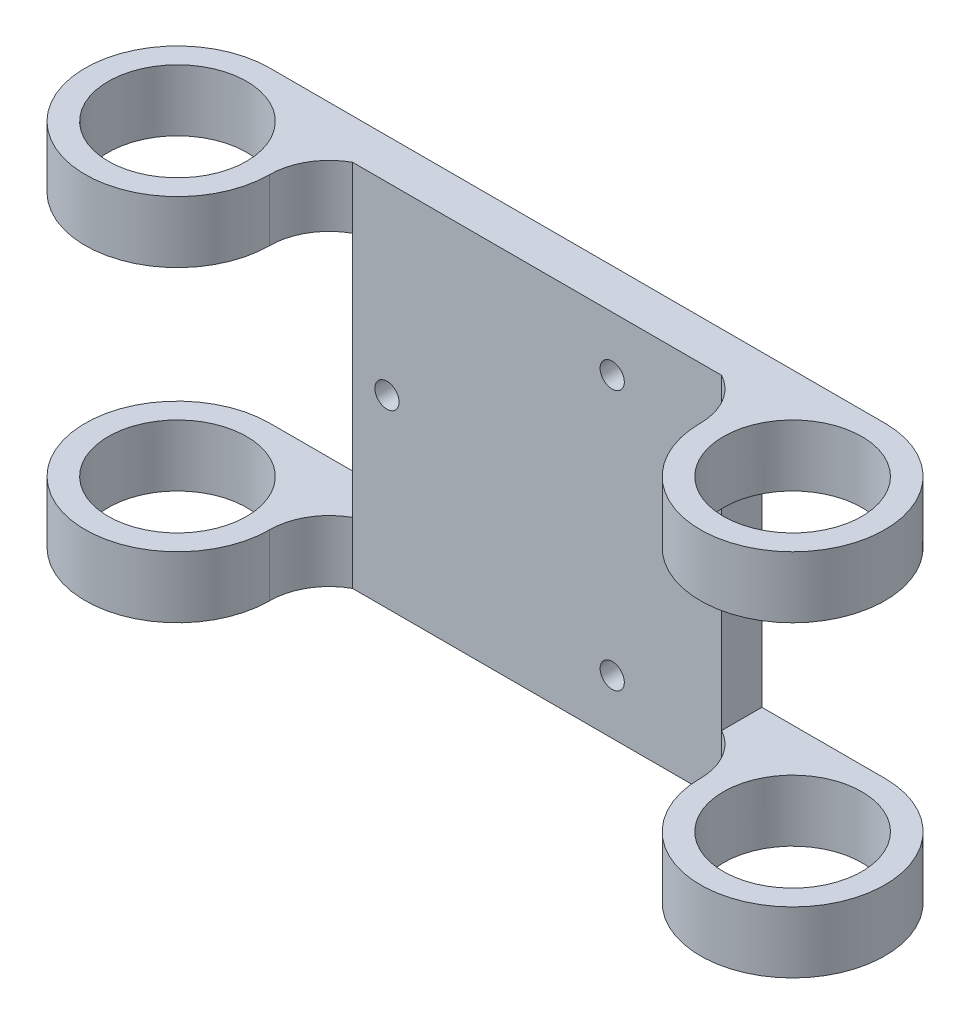
ISO-10303-21;
HEADER;
FILE_DESCRIPTION(('STEP AP214'),'2;1');
FILE_NAME('part.step','',(''),(''),'','','');
FILE_SCHEMA(('AUTOMOTIVE_DESIGN { 1 0 10303 214 1 1 1 1 }'));
ENDSEC;
DATA;
#1=APPLICATION_CONTEXT('core data for automotive mechanical design processes');
#2=APPLICATION_PROTOCOL_DEFINITION('international standard','automotive_design',2000,#1);
#3=PRODUCT_CONTEXT('',#1,'mechanical');
#4=PRODUCT('Part','Part','',(#3));
#5=PRODUCT_RELATED_PRODUCT_CATEGORY('part','',(#4));
#6=PRODUCT_DEFINITION_FORMATION('','',#4);
#7=PRODUCT_DEFINITION_CONTEXT('part definition',#1,'design');
#8=PRODUCT_DEFINITION('design','',#6,#7);
#9=PRODUCT_DEFINITION_SHAPE('','',#8);
#10=(LENGTH_UNIT() NAMED_UNIT(*) SI_UNIT(.MILLI.,.METRE.));
#11=(NAMED_UNIT(*) PLANE_ANGLE_UNIT() SI_UNIT($,.RADIAN.));
#12=(NAMED_UNIT(*) SI_UNIT($,.STERADIAN.) SOLID_ANGLE_UNIT());
#13=UNCERTAINTY_MEASURE_WITH_UNIT(LENGTH_MEASURE(1.E-05),#10,'distance_accuracy_value','');
#14=(GEOMETRIC_REPRESENTATION_CONTEXT(3) GLOBAL_UNCERTAINTY_ASSIGNED_CONTEXT((#13)) GLOBAL_UNIT_ASSIGNED_CONTEXT((#10,
#11,#12)) REPRESENTATION_CONTEXT('',''));
#15=CARTESIAN_POINT('',(0.,0.,0.));
#16=DIRECTION('',(0.,0.,1.));
#17=DIRECTION('',(1.,0.,0.));
#18=AXIS2_PLACEMENT_3D('',#15,#16,#17);
#19=CARTESIAN_POINT('',(-63.5,76.2,19.05));
#20=DIRECTION('',(0.,-1.,0.));
#21=DIRECTION('',(0.,0.,-1.));
#22=AXIS2_PLACEMENT_3D('',#19,#20,#21);
#23=CYLINDRICAL_SURFACE('',#22,19.05);
#24=DIRECTION('',(0.,-1.,0.));
#25=VECTOR('',#24,1.);
#26=CARTESIAN_POINT('',(-63.5,76.2,0.));
#27=LINE('',#26,#25);
#28=CARTESIAN_POINT('',(-63.5,76.2,0.));
#29=VERTEX_POINT('',#28);
#30=CARTESIAN_POINT('',(-63.5,63.5,0.));
#31=VERTEX_POINT('',#30);
#32=EDGE_CURVE('E257',#29,#31,#27,.T.);
#33=ORIENTED_EDGE('',*,*,#32,.T.);
#34=CARTESIAN_POINT('',(-63.5,63.5,19.05));
#35=DIRECTION('',(0.,-1.,0.));
#36=DIRECTION('',(1.,0.,0.));
#37=AXIS2_PLACEMENT_3D('',#34,#35,#36);
#38=CIRCLE('',#37,19.05);
#39=CARTESIAN_POINT('',(-44.45,63.5,19.05));
#40=VERTEX_POINT('',#39);
#41=EDGE_CURVE('E298',#40,#31,#38,.T.);
#42=ORIENTED_EDGE('',*,*,#41,.F.);
#43=DIRECTION('',(0.,-1.,0.));
#44=VECTOR('',#43,1.);
#45=CARTESIAN_POINT('',(-44.45,76.2,19.05));
#46=LINE('',#45,#44);
#47=CARTESIAN_POINT('',(-44.45,76.2,19.05));
#48=VERTEX_POINT('',#47);
#49=EDGE_CURVE('E175',#48,#40,#46,.T.);
#50=ORIENTED_EDGE('',*,*,#49,.F.);
#51=CARTESIAN_POINT('',(-63.5,76.2,19.05));
#52=DIRECTION('',(0.,1.,0.));
#53=DIRECTION('',(0.,0.,1.));
#54=AXIS2_PLACEMENT_3D('',#51,#52,#53);
#55=CIRCLE('',#54,19.05);
#56=EDGE_CURVE('E228',#29,#48,#55,.T.);
#57=ORIENTED_EDGE('',*,*,#56,.F.);
#58=EDGE_LOOP('',(#33,#42,#50,#57));
#59=FACE_BOUND('',#58,.T.);
#60=ADVANCED_FACE('F32',(#59),#23,.T.);
#61=CARTESIAN_POINT('',(-63.5,12.7,19.05));
#62=DIRECTION('',(0.,-1.,0.));
#63=DIRECTION('',(1.,0.,0.));
#64=AXIS2_PLACEMENT_3D('',#61,#62,#63);
#65=CIRCLE('',#64,19.05);
#66=CARTESIAN_POINT('',(-44.45,12.7,19.05));
#67=VERTEX_POINT('',#66);
#68=CARTESIAN_POINT('',(-63.5,12.7,0.));
#69=VERTEX_POINT('',#68);
#70=EDGE_CURVE('E286',#67,#69,#65,.T.);
#71=ORIENTED_EDGE('',*,*,#70,.T.);
#72=CARTESIAN_POINT('',(-63.5,0.,0.));
#73=VERTEX_POINT('',#72);
#74=EDGE_CURVE('E241',#69,#73,#27,.T.);
#75=ORIENTED_EDGE('',*,*,#74,.T.);
#76=CARTESIAN_POINT('',(-63.5,0.,19.05));
#77=DIRECTION('',(0.,1.,0.));
#78=DIRECTION('',(0.,0.,1.));
#79=AXIS2_PLACEMENT_3D('',#76,#77,#78);
#80=CIRCLE('',#79,19.05);
#81=CARTESIAN_POINT('',(-44.45,0.,19.05));
#82=VERTEX_POINT('',#81);
#83=EDGE_CURVE('E225',#73,#82,#80,.T.);
#84=ORIENTED_EDGE('',*,*,#83,.T.);
#85=EDGE_CURVE('E174',#67,#82,#46,.T.);
#86=ORIENTED_EDGE('',*,*,#85,.F.);
#87=EDGE_LOOP('',(#71,#75,#84,#86));
#88=FACE_BOUND('',#87,.T.);
#89=ADVANCED_FACE('F285',(#88),#23,.T.);
#90=CARTESIAN_POINT('',(-32.1755905511812,76.2,19.05));
#91=DIRECTION('',(0.,-1.,0.));
#92=DIRECTION('',(0.,0.,-1.));
#93=AXIS2_PLACEMENT_3D('',#90,#91,#92);
#94=CYLINDRICAL_SURFACE('',#93,12.2744094488188);
#95=CARTESIAN_POINT('',(-32.1755905511812,63.5,19.05));
#96=DIRECTION('',(0.,-1.,0.));
#97=DIRECTION('',(1.,0.,0.));
#98=AXIS2_PLACEMENT_3D('',#95,#96,#97);
#99=CIRCLE('',#98,12.2744094488188);
#100=CARTESIAN_POINT('',(-38.1,63.5,8.30000000000001));
#101=VERTEX_POINT('',#100);
#102=EDGE_CURVE('E300',#101,#40,#99,.F.);
#103=ORIENTED_EDGE('',*,*,#102,.F.);
#104=DIRECTION('',(0.,-1.,0.));
#105=VECTOR('',#104,1.);
#106=CARTESIAN_POINT('',(-38.1,76.2,8.30000000000001));
#107=LINE('',#106,#105);
#108=CARTESIAN_POINT('',(-38.1,76.2,8.30000000000001));
#109=VERTEX_POINT('',#108);
#110=EDGE_CURVE('E167',#109,#101,#107,.T.);
#111=ORIENTED_EDGE('',*,*,#110,.F.);
#112=CARTESIAN_POINT('',(-32.1755905511812,76.2,19.05));
#113=DIRECTION('',(0.,-1.,0.));
#114=DIRECTION('',(0.,0.,-1.));
#115=AXIS2_PLACEMENT_3D('',#112,#113,#114);
#116=CIRCLE('',#115,12.2744094488188);
#117=EDGE_CURVE('E231',#48,#109,#116,.T.);
#118=ORIENTED_EDGE('',*,*,#117,.F.);
#119=ORIENTED_EDGE('',*,*,#49,.T.);
#120=EDGE_LOOP('',(#103,#111,#118,#119));
#121=FACE_BOUND('',#120,.T.);
#122=ADVANCED_FACE('F315',(#121),#94,.F.);
#123=CARTESIAN_POINT('',(32.1755905511812,76.2,19.05));
#124=DIRECTION('',(0.,-1.,0.));
#125=DIRECTION('',(0.,0.,-1.));
#126=AXIS2_PLACEMENT_3D('',#123,#124,#125);
#127=CYLINDRICAL_SURFACE('',#126,12.2744094488189);
#128=CARTESIAN_POINT('',(32.1755905511812,12.7,19.05));
#129=DIRECTION('',(0.,1.,0.));
#130=DIRECTION('',(-1.,0.,0.));
#131=AXIS2_PLACEMENT_3D('',#128,#129,#130);
#132=CIRCLE('',#131,12.2744094488189);
#133=CARTESIAN_POINT('',(38.1,12.7,8.30000000000001));
#134=VERTEX_POINT('',#133);
#135=CARTESIAN_POINT('',(44.45,12.7,19.05));
#136=VERTEX_POINT('',#135);
#137=EDGE_CURVE('E188',#134,#136,#132,.F.);
#138=ORIENTED_EDGE('',*,*,#137,.F.);
#139=DIRECTION('',(0.,-1.,0.));
#140=VECTOR('',#139,1.);
#141=CARTESIAN_POINT('',(38.1,76.2,8.3));
#142=LINE('',#141,#140);
#143=CARTESIAN_POINT('',(38.1,0.,8.3));
#144=VERTEX_POINT('',#143);
#145=EDGE_CURVE('E159',#134,#144,#142,.T.);
#146=ORIENTED_EDGE('',*,*,#145,.T.);
#147=CARTESIAN_POINT('',(32.1755905511812,0.,19.05));
#148=DIRECTION('',(0.,-1.,0.));
#149=DIRECTION('',(0.,0.,1.));
#150=AXIS2_PLACEMENT_3D('',#147,#148,#149);
#151=CIRCLE('',#150,12.2744094488189);
#152=CARTESIAN_POINT('',(44.45,0.,19.05));
#153=VERTEX_POINT('',#152);
#154=EDGE_CURVE('E249',#144,#153,#151,.T.);
#155=ORIENTED_EDGE('',*,*,#154,.T.);
#156=DIRECTION('',(0.,-1.,0.));
#157=VECTOR('',#156,1.);
#158=CARTESIAN_POINT('',(44.45,76.2,19.05));
#159=LINE('',#158,#157);
#160=EDGE_CURVE('E262',#136,#153,#159,.T.);
#161=ORIENTED_EDGE('',*,*,#160,.F.);
#162=EDGE_LOOP('',(#138,#146,#155,#161));
#163=FACE_BOUND('',#162,.T.);
#164=ADVANCED_FACE('F330',(#163),#127,.F.);
#165=CARTESIAN_POINT('',(63.5,76.2,19.05));
#166=DIRECTION('',(0.,-1.,0.));
#167=DIRECTION('',(0.,0.,-1.));
#168=AXIS2_PLACEMENT_3D('',#165,#166,#167);
#169=CYLINDRICAL_SURFACE('',#168,19.05);
#170=DIRECTION('',(0.,-1.,0.));
#171=VECTOR('',#170,1.);
#172=CARTESIAN_POINT('',(63.5,76.2,0.));
#173=LINE('',#172,#171);
#174=CARTESIAN_POINT('',(63.5,12.7,0.));
#175=VERTEX_POINT('',#174);
#176=CARTESIAN_POINT('',(63.5,0.,0.));
#177=VERTEX_POINT('',#176);
#178=EDGE_CURVE('E259',#175,#177,#173,.T.);
#179=ORIENTED_EDGE('',*,*,#178,.F.);
#180=CARTESIAN_POINT('',(63.5,12.7,19.05));
#181=DIRECTION('',(0.,1.,0.));
#182=DIRECTION('',(-1.,0.,0.));
#183=AXIS2_PLACEMENT_3D('',#180,#181,#182);
#184=CIRCLE('',#183,19.05);
#185=EDGE_CURVE('E348',#136,#175,#184,.T.);
#186=ORIENTED_EDGE('',*,*,#185,.F.);
#187=ORIENTED_EDGE('',*,*,#160,.T.);
#188=CARTESIAN_POINT('',(63.5,0.,19.05));
#189=DIRECTION('',(0.,1.,0.));
#190=DIRECTION('',(0.,0.,-1.));
#191=AXIS2_PLACEMENT_3D('',#188,#189,#190);
#192=CIRCLE('',#191,19.05);
#193=EDGE_CURVE('E252',#153,#177,#192,.T.);
#194=ORIENTED_EDGE('',*,*,#193,.T.);
#195=EDGE_LOOP('',(#179,#186,#187,#194));
#196=FACE_BOUND('',#195,.T.);
#197=ADVANCED_FACE('F275',(#196),#169,.T.);
#198=CARTESIAN_POINT('',(63.5,63.5,19.05));
#199=DIRECTION('',(0.,1.,0.));
#200=DIRECTION('',(-1.,0.,0.));
#201=AXIS2_PLACEMENT_3D('',#198,#199,#200);
#202=CIRCLE('',#201,19.05);
#203=CARTESIAN_POINT('',(44.45,63.5,19.05));
#204=VERTEX_POINT('',#203);
#205=CARTESIAN_POINT('',(63.5,63.5,0.));
#206=VERTEX_POINT('',#205);
#207=EDGE_CURVE('E139',#204,#206,#202,.T.);
#208=ORIENTED_EDGE('',*,*,#207,.T.);
#209=CARTESIAN_POINT('',(63.5,76.2,0.));
#210=VERTEX_POINT('',#209);
#211=EDGE_CURVE('E260',#210,#206,#173,.T.);
#212=ORIENTED_EDGE('',*,*,#211,.F.);
#213=CARTESIAN_POINT('',(63.5,76.2,19.05));
#214=DIRECTION('',(0.,1.,0.));
#215=DIRECTION('',(0.,0.,-1.));
#216=AXIS2_PLACEMENT_3D('',#213,#214,#215);
#217=CIRCLE('',#216,19.05);
#218=CARTESIAN_POINT('',(44.45,76.2,19.05));
#219=VERTEX_POINT('',#218);
#220=EDGE_CURVE('E237',#219,#210,#217,.T.);
#221=ORIENTED_EDGE('',*,*,#220,.F.);
#222=EDGE_CURVE('E169',#219,#204,#159,.T.);
#223=ORIENTED_EDGE('',*,*,#222,.T.);
#224=EDGE_LOOP('',(#208,#212,#221,#223));
#225=FACE_BOUND('',#224,.T.);
#226=ADVANCED_FACE('F355',(#225),#169,.T.);
#227=CARTESIAN_POINT('',(63.5,76.2,0.));
#228=DIRECTION('',(0.,0.,1.));
#229=DIRECTION('',(1.,0.,0.));
#230=AXIS2_PLACEMENT_3D('',#227,#228,#229);
#231=PLANE('',#230);
#232=CARTESIAN_POINT('',(15.5001226769339,64.947,0.));
#233=DIRECTION('',(0.,0.,1.));
#234=DIRECTION('',(1.,0.,0.));
#235=AXIS2_PLACEMENT_3D('',#232,#233,#234);
#236=CIRCLE('',#235,2.5);
#237=CARTESIAN_POINT('',(18.0001226769339,64.947,0.));
#238=VERTEX_POINT('',#237);
#239=EDGE_CURVE('E195',#238,#238,#236,.T.);
#240=ORIENTED_EDGE('',*,*,#239,.T.);
#241=EDGE_LOOP('',(#240));
#242=FACE_BOUND('',#241,.T.);
#243=CARTESIAN_POINT('',(15.5001226769339,11.253,0.));
#244=DIRECTION('',(0.,0.,1.));
#245=DIRECTION('',(1.,0.,0.));
#246=AXIS2_PLACEMENT_3D('',#243,#244,#245);
#247=CIRCLE('',#246,2.5);
#248=CARTESIAN_POINT('',(18.0001226769339,11.253,0.));
#249=VERTEX_POINT('',#248);
#250=EDGE_CURVE('E200',#249,#249,#247,.T.);
#251=ORIENTED_EDGE('',*,*,#250,.T.);
#252=EDGE_LOOP('',(#251));
#253=FACE_BOUND('',#252,.T.);
#254=CARTESIAN_POINT('',(-31.0002453538678,38.1,0.));
#255=DIRECTION('',(0.,0.,1.));
#256=DIRECTION('',(1.,0.,0.));
#257=AXIS2_PLACEMENT_3D('',#254,#255,#256);
#258=CIRCLE('',#257,2.5);
#259=CARTESIAN_POINT('',(-28.5002453538678,38.1,0.));
#260=VERTEX_POINT('',#259);
#261=EDGE_CURVE('E203',#260,#260,#258,.T.);
#262=ORIENTED_EDGE('',*,*,#261,.T.);
#263=EDGE_LOOP('',(#262));
#264=FACE_BOUND('',#263,.T.);
#265=DIRECTION('',(-1.,0.,0.));
#266=VECTOR('',#265,1.);
#267=CARTESIAN_POINT('',(63.5,12.7,0.));
#268=LINE('',#267,#266);
#269=CARTESIAN_POINT('',(38.1,12.7,0.));
#270=VERTEX_POINT('',#269);
#271=EDGE_CURVE('E183',#175,#270,#268,.T.);
#272=ORIENTED_EDGE('',*,*,#271,.F.);
#273=ORIENTED_EDGE('',*,*,#178,.T.);
#274=DIRECTION('',(-1.,0.,0.));
#275=VECTOR('',#274,1.);
#276=CARTESIAN_POINT('',(63.5,0.,0.));
#277=LINE('',#276,#275);
#278=EDGE_CURVE('E232',#177,#73,#277,.T.);
#279=ORIENTED_EDGE('',*,*,#278,.T.);
#280=ORIENTED_EDGE('',*,*,#74,.F.);
#281=DIRECTION('',(1.,0.,0.));
#282=VECTOR('',#281,1.);
#283=CARTESIAN_POINT('',(63.5,12.7,0.));
#284=LINE('',#283,#282);
#285=CARTESIAN_POINT('',(-38.1,12.7,0.));
#286=VERTEX_POINT('',#285);
#287=EDGE_CURVE('E187',#69,#286,#284,.T.);
#288=ORIENTED_EDGE('',*,*,#287,.T.);
#289=DIRECTION('',(0.,-1.,0.));
#290=VECTOR('',#289,1.);
#291=CARTESIAN_POINT('',(-38.1,76.2,0.));
#292=LINE('',#291,#290);
#293=CARTESIAN_POINT('',(-38.1,63.5,0.));
#294=VERTEX_POINT('',#293);
#295=EDGE_CURVE('E39',#294,#286,#292,.T.);
#296=ORIENTED_EDGE('',*,*,#295,.F.);
#297=DIRECTION('',(1.,0.,0.));
#298=VECTOR('',#297,1.);
#299=CARTESIAN_POINT('',(63.5,63.5,0.));
#300=LINE('',#299,#298);
#301=EDGE_CURVE('E192',#31,#294,#300,.T.);
#302=ORIENTED_EDGE('',*,*,#301,.F.);
#303=ORIENTED_EDGE('',*,*,#32,.F.);
#304=DIRECTION('',(-1.,0.,0.));
#305=VECTOR('',#304,1.);
#306=CARTESIAN_POINT('',(63.5,76.2,0.));
#307=LINE('',#306,#305);
#308=EDGE_CURVE('E239',#210,#29,#307,.T.);
#309=ORIENTED_EDGE('',*,*,#308,.F.);
#310=ORIENTED_EDGE('',*,*,#211,.T.);
#311=DIRECTION('',(-1.,0.,0.));
#312=VECTOR('',#311,1.);
#313=CARTESIAN_POINT('',(63.5,63.5,0.));
#314=LINE('',#313,#312);
#315=CARTESIAN_POINT('',(38.1,63.5,0.));
#316=VERTEX_POINT('',#315);
#317=EDGE_CURVE('E180',#206,#316,#314,.T.);
#318=ORIENTED_EDGE('',*,*,#317,.T.);
#319=DIRECTION('',(0.,-1.,0.));
#320=VECTOR('',#319,1.);
#321=CARTESIAN_POINT('',(38.1,76.2,0.));
#322=LINE('',#321,#320);
#323=EDGE_CURVE('E11',#316,#270,#322,.T.);
#324=ORIENTED_EDGE('',*,*,#323,.T.);
#325=EDGE_LOOP('',(#272,#273,#279,#280,#288,#296,#302,#303,#309,#310,#318,#324));
#326=FACE_BOUND('',#325,.T.);
#327=ADVANCED_FACE('F268',(#242,#253,#264,#326),#231,.F.);
#328=CARTESIAN_POINT('',(-63.5,76.2,19.05));
#329=DIRECTION('',(0.,-1.,0.));
#330=DIRECTION('',(0.,0.,-1.));
#331=AXIS2_PLACEMENT_3D('',#328,#329,#330);
#332=CYLINDRICAL_SURFACE('',#331,14.2875);
#333=CARTESIAN_POINT('',(-63.5,76.2,19.05));
#334=DIRECTION('',(0.,1.,0.));
#335=DIRECTION('',(0.,0.,1.));
#336=AXIS2_PLACEMENT_3D('',#333,#334,#335);
#337=CIRCLE('',#336,14.2875);
#338=CARTESIAN_POINT('',(-63.5,76.2,33.3375));
#339=VERTEX_POINT('',#338);
#340=EDGE_CURVE('E222',#339,#339,#337,.T.);
#341=ORIENTED_EDGE('',*,*,#340,.T.);
#342=EDGE_LOOP('',(#341));
#343=FACE_BOUND('',#342,.T.);
#344=CARTESIAN_POINT('',(-63.5,63.5,19.05));
#345=DIRECTION('',(0.,-1.,0.));
#346=DIRECTION('',(1.,0.,0.));
#347=AXIS2_PLACEMENT_3D('',#344,#345,#346);
#348=CIRCLE('',#347,14.2875);
#349=CARTESIAN_POINT('',(-49.2125,63.5,19.05));
#350=VERTEX_POINT('',#349);
#351=EDGE_CURVE('E189',#350,#350,#348,.T.);
#352=ORIENTED_EDGE('',*,*,#351,.T.);
#353=EDGE_LOOP('',(#352));
#354=FACE_BOUND('',#353,.T.);
#355=ADVANCED_FACE('F363',(#343,#354),#332,.F.);
#356=CARTESIAN_POINT('',(63.5,76.2,19.05));
#357=DIRECTION('',(0.,-1.,0.));
#358=DIRECTION('',(0.,0.,-1.));
#359=AXIS2_PLACEMENT_3D('',#356,#357,#358);
#360=CYLINDRICAL_SURFACE('',#359,14.2875);
#361=CARTESIAN_POINT('',(63.5,0.,19.05));
#362=DIRECTION('',(0.,1.,0.));
#363=DIRECTION('',(0.,0.,1.));
#364=AXIS2_PLACEMENT_3D('',#361,#362,#363);
#365=CIRCLE('',#364,14.2875);
#366=CARTESIAN_POINT('',(63.5,0.,33.3375));
#367=VERTEX_POINT('',#366);
#368=EDGE_CURVE('E160',#367,#367,#365,.T.);
#369=ORIENTED_EDGE('',*,*,#368,.F.);
#370=EDGE_LOOP('',(#369));
#371=FACE_BOUND('',#370,.T.);
#372=CARTESIAN_POINT('',(63.5,12.7,19.05));
#373=DIRECTION('',(0.,1.,0.));
#374=DIRECTION('',(-1.,0.,0.));
#375=AXIS2_PLACEMENT_3D('',#372,#373,#374);
#376=CIRCLE('',#375,14.2875);
#377=CARTESIAN_POINT('',(49.2125,12.7,19.05));
#378=VERTEX_POINT('',#377);
#379=EDGE_CURVE('E144',#378,#378,#376,.T.);
#380=ORIENTED_EDGE('',*,*,#379,.T.);
#381=EDGE_LOOP('',(#380));
#382=FACE_BOUND('',#381,.T.);
#383=ADVANCED_FACE('F379',(#371,#382),#360,.F.);
#384=CARTESIAN_POINT('',(-63.5,76.2,19.05));
#385=DIRECTION('',(0.,1.,0.));
#386=DIRECTION('',(0.,0.,1.));
#387=AXIS2_PLACEMENT_3D('',#384,#385,#386);
#388=PLANE('',#387);
#389=ORIENTED_EDGE('',*,*,#340,.F.);
#390=EDGE_LOOP('',(#389));
#391=FACE_BOUND('',#390,.T.);
#392=ORIENTED_EDGE('',*,*,#56,.T.);
#393=ORIENTED_EDGE('',*,*,#117,.T.);
#394=DIRECTION('',(1.,0.,0.));
#395=VECTOR('',#394,1.);
#396=CARTESIAN_POINT('',(38.1,76.2,8.3));
#397=LINE('',#396,#395);
#398=CARTESIAN_POINT('',(38.1,76.2,8.3));
#399=VERTEX_POINT('',#398);
#400=EDGE_CURVE('E234',#109,#399,#397,.T.);
#401=ORIENTED_EDGE('',*,*,#400,.T.);
#402=CARTESIAN_POINT('',(32.1755905511812,76.2,19.05));
#403=DIRECTION('',(0.,-1.,0.));
#404=DIRECTION('',(0.,0.,1.));
#405=AXIS2_PLACEMENT_3D('',#402,#403,#404);
#406=CIRCLE('',#405,12.2744094488189);
#407=EDGE_CURVE('E164',#399,#219,#406,.T.);
#408=ORIENTED_EDGE('',*,*,#407,.T.);
#409=ORIENTED_EDGE('',*,*,#220,.T.);
#410=ORIENTED_EDGE('',*,*,#308,.T.);
#411=EDGE_LOOP('',(#392,#393,#401,#408,#409,#410));
#412=FACE_BOUND('',#411,.T.);
#413=CARTESIAN_POINT('',(63.5,76.2,19.05));
#414=DIRECTION('',(0.,1.,0.));
#415=DIRECTION('',(0.,0.,1.));
#416=AXIS2_PLACEMENT_3D('',#413,#414,#415);
#417=CIRCLE('',#416,14.2875);
#418=CARTESIAN_POINT('',(63.5,76.2,33.3375));
#419=VERTEX_POINT('',#418);
#420=EDGE_CURVE('E216',#419,#419,#417,.T.);
#421=ORIENTED_EDGE('',*,*,#420,.F.);
#422=EDGE_LOOP('',(#421));
#423=FACE_BOUND('',#422,.T.);
#424=ADVANCED_FACE('F318',(#391,#412,#423),#388,.T.);
#425=CARTESIAN_POINT('',(-63.5,0.,19.05));
#426=DIRECTION('',(0.,1.,0.));
#427=DIRECTION('',(0.,0.,1.));
#428=AXIS2_PLACEMENT_3D('',#425,#426,#427);
#429=PLANE('',#428);
#430=ORIENTED_EDGE('',*,*,#83,.F.);
#431=ORIENTED_EDGE('',*,*,#278,.F.);
#432=ORIENTED_EDGE('',*,*,#193,.F.);
#433=ORIENTED_EDGE('',*,*,#154,.F.);
#434=DIRECTION('',(1.,0.,0.));
#435=VECTOR('',#434,1.);
#436=CARTESIAN_POINT('',(38.1,0.,8.3));
#437=LINE('',#436,#435);
#438=CARTESIAN_POINT('',(-38.1,0.,8.30000000000001));
#439=VERTEX_POINT('',#438);
#440=EDGE_CURVE('E247',#439,#144,#437,.T.);
#441=ORIENTED_EDGE('',*,*,#440,.F.);
#442=CARTESIAN_POINT('',(-32.1755905511812,0.,19.05));
#443=DIRECTION('',(0.,-1.,0.));
#444=DIRECTION('',(0.,0.,-1.));
#445=AXIS2_PLACEMENT_3D('',#442,#443,#444);
#446=CIRCLE('',#445,12.2744094488188);
#447=EDGE_CURVE('E244',#82,#439,#446,.T.);
#448=ORIENTED_EDGE('',*,*,#447,.F.);
#449=EDGE_LOOP('',(#430,#431,#432,#433,#441,#448));
#450=FACE_BOUND('',#449,.T.);
#451=CARTESIAN_POINT('',(-63.5,0.,19.05));
#452=DIRECTION('',(0.,1.,0.));
#453=DIRECTION('',(0.,0.,1.));
#454=AXIS2_PLACEMENT_3D('',#451,#452,#453);
#455=CIRCLE('',#454,14.2875);
#456=CARTESIAN_POINT('',(-63.5,0.,33.3375));
#457=VERTEX_POINT('',#456);
#458=EDGE_CURVE('E219',#457,#457,#455,.T.);
#459=ORIENTED_EDGE('',*,*,#458,.T.);
#460=EDGE_LOOP('',(#459));
#461=FACE_BOUND('',#460,.T.);
#462=ORIENTED_EDGE('',*,*,#368,.T.);
#463=EDGE_LOOP('',(#462));
#464=FACE_BOUND('',#463,.T.);
#465=ADVANCED_FACE('F279',(#450,#461,#464),#429,.F.);
#466=CARTESIAN_POINT('',(-38.1,12.7,8.30000000000001));
#467=VERTEX_POINT('',#466);
#468=EDGE_CURVE('E165',#467,#439,#107,.T.);
#469=ORIENTED_EDGE('',*,*,#468,.F.);
#470=CARTESIAN_POINT('',(-32.1755905511812,12.7,19.05));
#471=DIRECTION('',(0.,-1.,0.));
#472=DIRECTION('',(1.,0.,0.));
#473=AXIS2_PLACEMENT_3D('',#470,#471,#472);
#474=CIRCLE('',#473,12.2744094488188);
#475=EDGE_CURVE('E193',#467,#67,#474,.F.);
#476=ORIENTED_EDGE('',*,*,#475,.T.);
#477=ORIENTED_EDGE('',*,*,#85,.T.);
#478=ORIENTED_EDGE('',*,*,#447,.T.);
#479=EDGE_LOOP('',(#469,#476,#477,#478));
#480=FACE_BOUND('',#479,.T.);
#481=ADVANCED_FACE('F331',(#480),#94,.F.);
#482=CARTESIAN_POINT('',(38.1,76.2,8.3));
#483=DIRECTION('',(0.,0.,-1.));
#484=DIRECTION('',(-1.,0.,0.));
#485=AXIS2_PLACEMENT_3D('',#482,#483,#484);
#486=PLANE('',#485);
#487=CARTESIAN_POINT('',(-31.0002453538678,38.1,8.30000000000001));
#488=DIRECTION('',(0.,0.,-1.));
#489=DIRECTION('',(-1.,0.,0.));
#490=AXIS2_PLACEMENT_3D('',#487,#488,#489);
#491=CIRCLE('',#490,2.5);
#492=CARTESIAN_POINT('',(-33.5002453538678,38.1,8.30000000000001));
#493=VERTEX_POINT('',#492);
#494=EDGE_CURVE('E161',#493,#493,#491,.T.);
#495=ORIENTED_EDGE('',*,*,#494,.T.);
#496=EDGE_LOOP('',(#495));
#497=FACE_BOUND('',#496,.T.);
#498=CARTESIAN_POINT('',(15.5001226769339,11.253,8.30000000000001));
#499=DIRECTION('',(0.,0.,-1.));
#500=DIRECTION('',(-1.,0.,0.));
#501=AXIS2_PLACEMENT_3D('',#498,#499,#500);
#502=CIRCLE('',#501,2.5);
#503=CARTESIAN_POINT('',(13.0001226769339,11.253,8.30000000000001));
#504=VERTEX_POINT('',#503);
#505=EDGE_CURVE('E202',#504,#504,#502,.T.);
#506=ORIENTED_EDGE('',*,*,#505,.T.);
#507=EDGE_LOOP('',(#506));
#508=FACE_BOUND('',#507,.T.);
#509=CARTESIAN_POINT('',(15.5001226769339,64.947,8.30000000000001));
#510=DIRECTION('',(0.,0.,-1.));
#511=DIRECTION('',(-1.,0.,0.));
#512=AXIS2_PLACEMENT_3D('',#509,#510,#511);
#513=CIRCLE('',#512,2.5);
#514=CARTESIAN_POINT('',(13.0001226769339,64.947,8.30000000000001));
#515=VERTEX_POINT('',#514);
#516=EDGE_CURVE('E198',#515,#515,#513,.T.);
#517=ORIENTED_EDGE('',*,*,#516,.T.);
#518=EDGE_LOOP('',(#517));
#519=FACE_BOUND('',#518,.T.);
#520=ORIENTED_EDGE('',*,*,#440,.T.);
#521=ORIENTED_EDGE('',*,*,#145,.F.);
#522=DIRECTION('',(0.,-1.,0.));
#523=VECTOR('',#522,1.);
#524=CARTESIAN_POINT('',(38.1,76.2,8.30000000000001));
#525=LINE('',#524,#523);
#526=CARTESIAN_POINT('',(38.1,63.5,8.30000000000001));
#527=VERTEX_POINT('',#526);
#528=EDGE_CURVE('E148',#134,#527,#525,.F.);
#529=ORIENTED_EDGE('',*,*,#528,.T.);
#530=EDGE_CURVE('E157',#399,#527,#142,.T.);
#531=ORIENTED_EDGE('',*,*,#530,.F.);
#532=ORIENTED_EDGE('',*,*,#400,.F.);
#533=ORIENTED_EDGE('',*,*,#110,.T.);
#534=DIRECTION('',(0.,1.,0.));
#535=VECTOR('',#534,1.);
#536=CARTESIAN_POINT('',(-38.1,76.2,8.30000000000001));
#537=LINE('',#536,#535);
#538=EDGE_CURVE('E199',#467,#101,#537,.T.);
#539=ORIENTED_EDGE('',*,*,#538,.F.);
#540=ORIENTED_EDGE('',*,*,#468,.T.);
#541=EDGE_LOOP('',(#520,#521,#529,#531,#532,#533,#539,#540));
#542=FACE_BOUND('',#541,.T.);
#543=ADVANCED_FACE('F155',(#497,#508,#519,#542),#486,.F.);
#544=ORIENTED_EDGE('',*,*,#530,.T.);
#545=CARTESIAN_POINT('',(32.1755905511812,63.5,19.05));
#546=DIRECTION('',(0.,1.,0.));
#547=DIRECTION('',(-1.,0.,0.));
#548=AXIS2_PLACEMENT_3D('',#545,#546,#547);
#549=CIRCLE('',#548,12.2744094488189);
#550=EDGE_CURVE('E133',#527,#204,#549,.F.);
#551=ORIENTED_EDGE('',*,*,#550,.T.);
#552=ORIENTED_EDGE('',*,*,#222,.F.);
#553=ORIENTED_EDGE('',*,*,#407,.F.);
#554=EDGE_LOOP('',(#544,#551,#552,#553));
#555=FACE_BOUND('',#554,.T.);
#556=ADVANCED_FACE('F163',(#555),#127,.F.);
#557=CARTESIAN_POINT('',(-63.5,12.7,19.05));
#558=DIRECTION('',(0.,-1.,0.));
#559=DIRECTION('',(1.,0.,0.));
#560=AXIS2_PLACEMENT_3D('',#557,#558,#559);
#561=CIRCLE('',#560,14.2875);
#562=CARTESIAN_POINT('',(-49.2125,12.7,19.05));
#563=VERTEX_POINT('',#562);
#564=EDGE_CURVE('E184',#563,#563,#561,.T.);
#565=ORIENTED_EDGE('',*,*,#564,.F.);
#566=EDGE_LOOP('',(#565));
#567=FACE_BOUND('',#566,.T.);
#568=ORIENTED_EDGE('',*,*,#458,.F.);
#569=EDGE_LOOP('',(#568));
#570=FACE_BOUND('',#569,.T.);
#571=ADVANCED_FACE('F367',(#567,#570),#332,.F.);
#572=CARTESIAN_POINT('',(63.5,63.5,19.05));
#573=DIRECTION('',(0.,1.,0.));
#574=DIRECTION('',(-1.,0.,0.));
#575=AXIS2_PLACEMENT_3D('',#572,#573,#574);
#576=CIRCLE('',#575,14.2875);
#577=CARTESIAN_POINT('',(49.2125,63.5,19.05));
#578=VERTEX_POINT('',#577);
#579=EDGE_CURVE('E149',#578,#578,#576,.T.);
#580=ORIENTED_EDGE('',*,*,#579,.F.);
#581=EDGE_LOOP('',(#580));
#582=FACE_BOUND('',#581,.T.);
#583=ORIENTED_EDGE('',*,*,#420,.T.);
#584=EDGE_LOOP('',(#583));
#585=FACE_BOUND('',#584,.T.);
#586=ADVANCED_FACE('F371',(#582,#585),#360,.F.);
#587=CARTESIAN_POINT('',(38.1,0.,38.1));
#588=DIRECTION('',(-1.,0.,0.));
#589=DIRECTION('',(0.,0.,1.));
#590=AXIS2_PLACEMENT_3D('',#587,#588,#589);
#591=PLANE('',#590);
#592=DIRECTION('',(0.,0.,-1.));
#593=VECTOR('',#592,1.);
#594=CARTESIAN_POINT('',(38.1,12.7,38.1));
#595=LINE('',#594,#593);
#596=EDGE_CURVE('E46',#134,#270,#595,.T.);
#597=ORIENTED_EDGE('',*,*,#596,.T.);
#598=ORIENTED_EDGE('',*,*,#323,.F.);
#599=DIRECTION('',(0.,0.,-1.));
#600=VECTOR('',#599,1.);
#601=CARTESIAN_POINT('',(38.1,63.5,38.1));
#602=LINE('',#601,#600);
#603=EDGE_CURVE('E137',#527,#316,#602,.T.);
#604=ORIENTED_EDGE('',*,*,#603,.F.);
#605=ORIENTED_EDGE('',*,*,#528,.F.);
#606=EDGE_LOOP('',(#597,#598,#604,#605));
#607=FACE_BOUND('',#606,.T.);
#608=ADVANCED_FACE('F147',(#607),#591,.F.);
#609=CARTESIAN_POINT('',(0.,12.7,38.1));
#610=DIRECTION('',(0.,1.,0.));
#611=DIRECTION('',(-1.,0.,0.));
#612=AXIS2_PLACEMENT_3D('',#609,#610,#611);
#613=PLANE('',#612);
#614=ORIENTED_EDGE('',*,*,#379,.F.);
#615=EDGE_LOOP('',(#614));
#616=FACE_BOUND('',#615,.T.);
#617=ORIENTED_EDGE('',*,*,#137,.T.);
#618=ORIENTED_EDGE('',*,*,#185,.T.);
#619=ORIENTED_EDGE('',*,*,#271,.T.);
#620=ORIENTED_EDGE('',*,*,#596,.F.);
#621=EDGE_LOOP('',(#617,#618,#619,#620));
#622=FACE_BOUND('',#621,.T.);
#623=ADVANCED_FACE('F428',(#616,#622),#613,.T.);
#624=CARTESIAN_POINT('',(0.,63.5,38.1));
#625=DIRECTION('',(0.,1.,0.));
#626=DIRECTION('',(-1.,0.,0.));
#627=AXIS2_PLACEMENT_3D('',#624,#625,#626);
#628=PLANE('',#627);
#629=ORIENTED_EDGE('',*,*,#579,.T.);
#630=EDGE_LOOP('',(#629));
#631=FACE_BOUND('',#630,.T.);
#632=ORIENTED_EDGE('',*,*,#603,.T.);
#633=ORIENTED_EDGE('',*,*,#317,.F.);
#634=ORIENTED_EDGE('',*,*,#207,.F.);
#635=ORIENTED_EDGE('',*,*,#550,.F.);
#636=EDGE_LOOP('',(#632,#633,#634,#635));
#637=FACE_BOUND('',#636,.T.);
#638=ADVANCED_FACE('F135',(#631,#637),#628,.F.);
#639=CARTESIAN_POINT('',(-38.1,0.,38.1000000000001));
#640=DIRECTION('',(-1.,0.,0.));
#641=DIRECTION('',(0.,0.,1.));
#642=AXIS2_PLACEMENT_3D('',#639,#640,#641);
#643=PLANE('',#642);
#644=ORIENTED_EDGE('',*,*,#538,.T.);
#645=DIRECTION('',(0.,0.,-1.));
#646=VECTOR('',#645,1.);
#647=CARTESIAN_POINT('',(-38.1,63.5,38.1000000000001));
#648=LINE('',#647,#646);
#649=EDGE_CURVE('E306',#101,#294,#648,.T.);
#650=ORIENTED_EDGE('',*,*,#649,.T.);
#651=ORIENTED_EDGE('',*,*,#295,.T.);
#652=DIRECTION('',(0.,0.,-1.));
#653=VECTOR('',#652,1.);
#654=CARTESIAN_POINT('',(-38.1,12.7,38.1000000000001));
#655=LINE('',#654,#653);
#656=EDGE_CURVE('E54',#467,#286,#655,.T.);
#657=ORIENTED_EDGE('',*,*,#656,.F.);
#658=EDGE_LOOP('',(#644,#650,#651,#657));
#659=FACE_BOUND('',#658,.T.);
#660=ADVANCED_FACE('F305',(#659),#643,.T.);
#661=CARTESIAN_POINT('',(0.,63.5,38.1));
#662=DIRECTION('',(0.,-1.,0.));
#663=DIRECTION('',(1.,0.,0.));
#664=AXIS2_PLACEMENT_3D('',#661,#662,#663);
#665=PLANE('',#664);
#666=ORIENTED_EDGE('',*,*,#351,.F.);
#667=EDGE_LOOP('',(#666));
#668=FACE_BOUND('',#667,.T.);
#669=ORIENTED_EDGE('',*,*,#102,.T.);
#670=ORIENTED_EDGE('',*,*,#41,.T.);
#671=ORIENTED_EDGE('',*,*,#301,.T.);
#672=ORIENTED_EDGE('',*,*,#649,.F.);
#673=EDGE_LOOP('',(#669,#670,#671,#672));
#674=FACE_BOUND('',#673,.T.);
#675=ADVANCED_FACE('F310',(#668,#674),#665,.T.);
#676=CARTESIAN_POINT('',(0.,12.7,38.1));
#677=DIRECTION('',(0.,-1.,0.));
#678=DIRECTION('',(1.,0.,0.));
#679=AXIS2_PLACEMENT_3D('',#676,#677,#678);
#680=PLANE('',#679);
#681=ORIENTED_EDGE('',*,*,#564,.T.);
#682=EDGE_LOOP('',(#681));
#683=FACE_BOUND('',#682,.T.);
#684=ORIENTED_EDGE('',*,*,#656,.T.);
#685=ORIENTED_EDGE('',*,*,#287,.F.);
#686=ORIENTED_EDGE('',*,*,#70,.F.);
#687=ORIENTED_EDGE('',*,*,#475,.F.);
#688=EDGE_LOOP('',(#684,#685,#686,#687));
#689=FACE_BOUND('',#688,.T.);
#690=ADVANCED_FACE('F394',(#683,#689),#680,.F.);
#691=CARTESIAN_POINT('',(15.5001226769339,64.947,38.1));
#692=DIRECTION('',(0.,0.,-1.));
#693=DIRECTION('',(-1.,0.,0.));
#694=AXIS2_PLACEMENT_3D('',#691,#692,#693);
#695=CYLINDRICAL_SURFACE('',#694,2.5);
#696=ORIENTED_EDGE('',*,*,#239,.F.);
#697=EDGE_LOOP('',(#696));
#698=FACE_BOUND('',#697,.T.);
#699=ORIENTED_EDGE('',*,*,#516,.F.);
#700=EDGE_LOOP('',(#699));
#701=FACE_BOUND('',#700,.T.);
#702=ADVANCED_FACE('F400',(#698,#701),#695,.F.);
#703=CARTESIAN_POINT('',(15.5001226769339,11.253,38.1));
#704=DIRECTION('',(0.,0.,-1.));
#705=DIRECTION('',(-1.,0.,0.));
#706=AXIS2_PLACEMENT_3D('',#703,#704,#705);
#707=CYLINDRICAL_SURFACE('',#706,2.5);
#708=ORIENTED_EDGE('',*,*,#250,.F.);
#709=EDGE_LOOP('',(#708));
#710=FACE_BOUND('',#709,.T.);
#711=ORIENTED_EDGE('',*,*,#505,.F.);
#712=EDGE_LOOP('',(#711));
#713=FACE_BOUND('',#712,.T.);
#714=ADVANCED_FACE('F409',(#710,#713),#707,.F.);
#715=CARTESIAN_POINT('',(-31.0002453538678,38.1,38.1));
#716=DIRECTION('',(0.,0.,-1.));
#717=DIRECTION('',(-1.,0.,0.));
#718=AXIS2_PLACEMENT_3D('',#715,#716,#717);
#719=CYLINDRICAL_SURFACE('',#718,2.5);
#720=ORIENTED_EDGE('',*,*,#261,.F.);
#721=EDGE_LOOP('',(#720));
#722=FACE_BOUND('',#721,.T.);
#723=ORIENTED_EDGE('',*,*,#494,.F.);
#724=EDGE_LOOP('',(#723));
#725=FACE_BOUND('',#724,.T.);
#726=ADVANCED_FACE('F405',(#722,#725),#719,.F.);
#727=CLOSED_SHELL('',(#60,#89,#122,#164,#197,#226,#327,#355,#383,#424,#465,#481,#543,#556,#571,
#586,#608,#623,#638,#660,#675,#690,#702,#714,#726));
#728=MANIFOLD_SOLID_BREP('B2',#727);
#729=ADVANCED_BREP_SHAPE_REPRESENTATION('',(#18,#728),#14);
#730=SHAPE_DEFINITION_REPRESENTATION(#9,#729);
ENDSEC;
END-ISO-10303-21;
